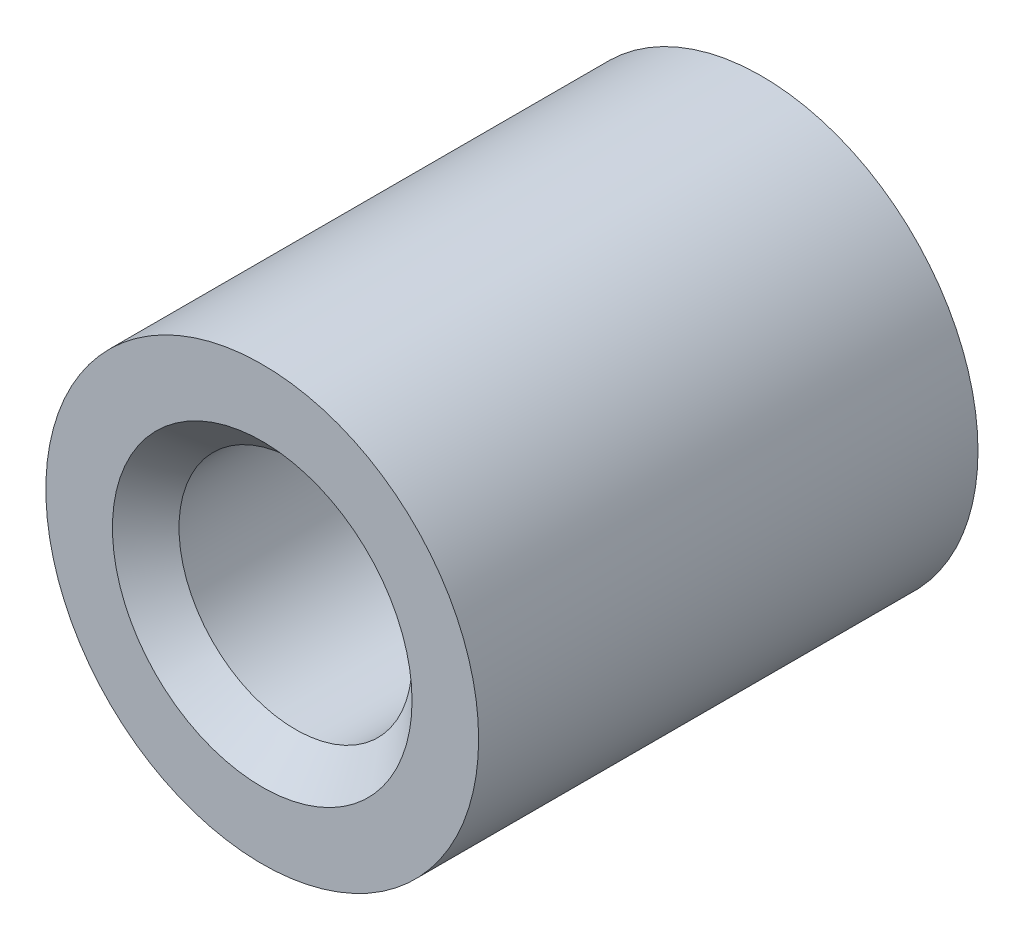
ISO-10303-21;
HEADER;
FILE_DESCRIPTION(('STEP AP214'),'2;1');
FILE_NAME('part.step','',(''),(''),'','','');
FILE_SCHEMA(('AUTOMOTIVE_DESIGN { 1 0 10303 214 1 1 1 1 }'));
ENDSEC;
DATA;
#1=APPLICATION_CONTEXT('core data for automotive mechanical design processes');
#2=APPLICATION_PROTOCOL_DEFINITION('international standard','automotive_design',2000,#1);
#3=PRODUCT_CONTEXT('',#1,'mechanical');
#4=PRODUCT('Part','Part','',(#3));
#5=PRODUCT_RELATED_PRODUCT_CATEGORY('part','',(#4));
#6=PRODUCT_DEFINITION_FORMATION('','',#4);
#7=PRODUCT_DEFINITION_CONTEXT('part definition',#1,'design');
#8=PRODUCT_DEFINITION('design','',#6,#7);
#9=PRODUCT_DEFINITION_SHAPE('','',#8);
#10=(LENGTH_UNIT() NAMED_UNIT(*) SI_UNIT(.MILLI.,.METRE.));
#11=(NAMED_UNIT(*) PLANE_ANGLE_UNIT() SI_UNIT($,.RADIAN.));
#12=(NAMED_UNIT(*) SI_UNIT($,.STERADIAN.) SOLID_ANGLE_UNIT());
#13=UNCERTAINTY_MEASURE_WITH_UNIT(LENGTH_MEASURE(1.E-05),#10,'distance_accuracy_value','');
#14=(GEOMETRIC_REPRESENTATION_CONTEXT(3) GLOBAL_UNCERTAINTY_ASSIGNED_CONTEXT((#13)) GLOBAL_UNIT_ASSIGNED_CONTEXT((#10,
#11,#12)) REPRESENTATION_CONTEXT('',''));
#15=CARTESIAN_POINT('',(0.,0.,0.));
#16=DIRECTION('',(0.,0.,1.));
#17=DIRECTION('',(1.,0.,0.));
#18=AXIS2_PLACEMENT_3D('',#15,#16,#17);
#19=CARTESIAN_POINT('',(0.,0.,15.));
#20=DIRECTION('',(0.,0.,1.));
#21=DIRECTION('',(1.,0.,0.));
#22=AXIS2_PLACEMENT_3D('',#19,#20,#21);
#23=PLANE('',#22);
#24=CARTESIAN_POINT('',(0.,0.,15.));
#25=DIRECTION('',(0.,0.,1.));
#26=DIRECTION('',(1.,0.,0.));
#27=AXIS2_PLACEMENT_3D('',#24,#25,#26);
#28=CIRCLE('',#27,4.50000000000001);
#29=CARTESIAN_POINT('',(4.50000000000001,0.,15.));
#30=VERTEX_POINT('',#29);
#31=EDGE_CURVE('E40',#30,#30,#28,.F.);
#32=ORIENTED_EDGE('',*,*,#31,.T.);
#33=EDGE_LOOP('',(#32));
#34=FACE_BOUND('',#33,.T.);
#35=CARTESIAN_POINT('',(0.,0.,15.));
#36=DIRECTION('',(0.,0.,1.));
#37=DIRECTION('',(1.,0.,0.));
#38=AXIS2_PLACEMENT_3D('',#35,#36,#37);
#39=CIRCLE('',#38,6.5);
#40=CARTESIAN_POINT('',(6.5,0.,15.));
#41=VERTEX_POINT('',#40);
#42=EDGE_CURVE('E53',#41,#41,#39,.T.);
#43=ORIENTED_EDGE('',*,*,#42,.T.);
#44=EDGE_LOOP('',(#43));
#45=FACE_BOUND('',#44,.T.);
#46=ADVANCED_FACE('F33',(#34,#45),#23,.T.);
#47=CARTESIAN_POINT('',(0.,0.,0.));
#48=DIRECTION('',(0.,0.,1.));
#49=DIRECTION('',(1.,0.,0.));
#50=AXIS2_PLACEMENT_3D('',#47,#48,#49);
#51=PLANE('',#50);
#52=CARTESIAN_POINT('',(0.,0.,0.));
#53=DIRECTION('',(0.,0.,1.));
#54=DIRECTION('',(1.,0.,0.));
#55=AXIS2_PLACEMENT_3D('',#52,#53,#54);
#56=CIRCLE('',#55,4.5);
#57=CARTESIAN_POINT('',(4.5,0.,0.));
#58=VERTEX_POINT('',#57);
#59=EDGE_CURVE('E10',#58,#58,#56,.T.);
#60=ORIENTED_EDGE('',*,*,#59,.T.);
#61=EDGE_LOOP('',(#60));
#62=FACE_BOUND('',#61,.T.);
#63=CARTESIAN_POINT('',(0.,0.,0.));
#64=DIRECTION('',(0.,0.,1.));
#65=DIRECTION('',(1.,0.,0.));
#66=AXIS2_PLACEMENT_3D('',#63,#64,#65);
#67=CIRCLE('',#66,6.5);
#68=CARTESIAN_POINT('',(6.5,0.,0.));
#69=VERTEX_POINT('',#68);
#70=EDGE_CURVE('E54',#69,#69,#67,.T.);
#71=ORIENTED_EDGE('',*,*,#70,.F.);
#72=EDGE_LOOP('',(#71));
#73=FACE_BOUND('',#72,.T.);
#74=ADVANCED_FACE('F65',(#62,#73),#51,.F.);
#75=CARTESIAN_POINT('',(0.,0.,15.));
#76=DIRECTION('',(0.,0.,-1.));
#77=DIRECTION('',(-1.,0.,0.));
#78=AXIS2_PLACEMENT_3D('',#75,#76,#77);
#79=CYLINDRICAL_SURFACE('',#78,6.5);
#80=ORIENTED_EDGE('',*,*,#42,.F.);
#81=EDGE_LOOP('',(#80));
#82=FACE_BOUND('',#81,.T.);
#83=ORIENTED_EDGE('',*,*,#70,.T.);
#84=EDGE_LOOP('',(#83));
#85=FACE_BOUND('',#84,.T.);
#86=ADVANCED_FACE('F61',(#82,#85),#79,.T.);
#87=CARTESIAN_POINT('',(0.,0.,15.));
#88=DIRECTION('',(0.,0.,-1.));
#89=DIRECTION('',(-1.,0.,0.));
#90=AXIS2_PLACEMENT_3D('',#87,#88,#89);
#91=CYLINDRICAL_SURFACE('',#90,3.5);
#92=CARTESIAN_POINT('',(0.,0.,14.));
#93=DIRECTION('',(0.,0.,1.));
#94=DIRECTION('',(1.,0.,0.));
#95=AXIS2_PLACEMENT_3D('',#92,#93,#94);
#96=CIRCLE('',#95,3.5);
#97=CARTESIAN_POINT('',(3.5,0.,14.));
#98=VERTEX_POINT('',#97);
#99=EDGE_CURVE('E44',#98,#98,#96,.T.);
#100=ORIENTED_EDGE('',*,*,#99,.T.);
#101=EDGE_LOOP('',(#100));
#102=FACE_BOUND('',#101,.T.);
#103=CARTESIAN_POINT('',(0.,0.,1.00000000000001));
#104=DIRECTION('',(0.,0.,1.));
#105=DIRECTION('',(1.,0.,0.));
#106=AXIS2_PLACEMENT_3D('',#103,#104,#105);
#107=CIRCLE('',#106,3.5);
#108=CARTESIAN_POINT('',(3.5,0.,1.00000000000001));
#109=VERTEX_POINT('',#108);
#110=EDGE_CURVE('E48',#109,#109,#107,.F.);
#111=ORIENTED_EDGE('',*,*,#110,.T.);
#112=EDGE_LOOP('',(#111));
#113=FACE_BOUND('',#112,.T.);
#114=ADVANCED_FACE('F64',(#102,#113),#91,.F.);
#115=CARTESIAN_POINT('',(0.,0.,14.));
#116=DIRECTION('',(0.,0.,1.));
#117=DIRECTION('',(1.,0.,0.));
#118=AXIS2_PLACEMENT_3D('',#115,#116,#117);
#119=CONICAL_SURFACE('',#118,3.5,0.785398163397448);
#120=ORIENTED_EDGE('',*,*,#31,.F.);
#121=EDGE_LOOP('',(#120));
#122=FACE_BOUND('',#121,.T.);
#123=ORIENTED_EDGE('',*,*,#99,.F.);
#124=EDGE_LOOP('',(#123));
#125=FACE_BOUND('',#124,.T.);
#126=ADVANCED_FACE('F76',(#122,#125),#119,.F.);
#127=CARTESIAN_POINT('',(0.,0.,0.));
#128=DIRECTION('',(0.,0.,-1.));
#129=DIRECTION('',(-1.,0.,0.));
#130=AXIS2_PLACEMENT_3D('',#127,#128,#129);
#131=CONICAL_SURFACE('',#130,4.5,0.785398163397445);
#132=ORIENTED_EDGE('',*,*,#110,.F.);
#133=EDGE_LOOP('',(#132));
#134=FACE_BOUND('',#133,.T.);
#135=ORIENTED_EDGE('',*,*,#59,.F.);
#136=EDGE_LOOP('',(#135));
#137=FACE_BOUND('',#136,.T.);
#138=ADVANCED_FACE('F35',(#134,#137),#131,.F.);
#139=CLOSED_SHELL('',(#46,#74,#86,#114,#126,#138));
#140=MANIFOLD_SOLID_BREP('B2',#139);
#141=ADVANCED_BREP_SHAPE_REPRESENTATION('',(#18,#140),#14);
#142=SHAPE_DEFINITION_REPRESENTATION(#9,#141);
ENDSEC;
END-ISO-10303-21;
